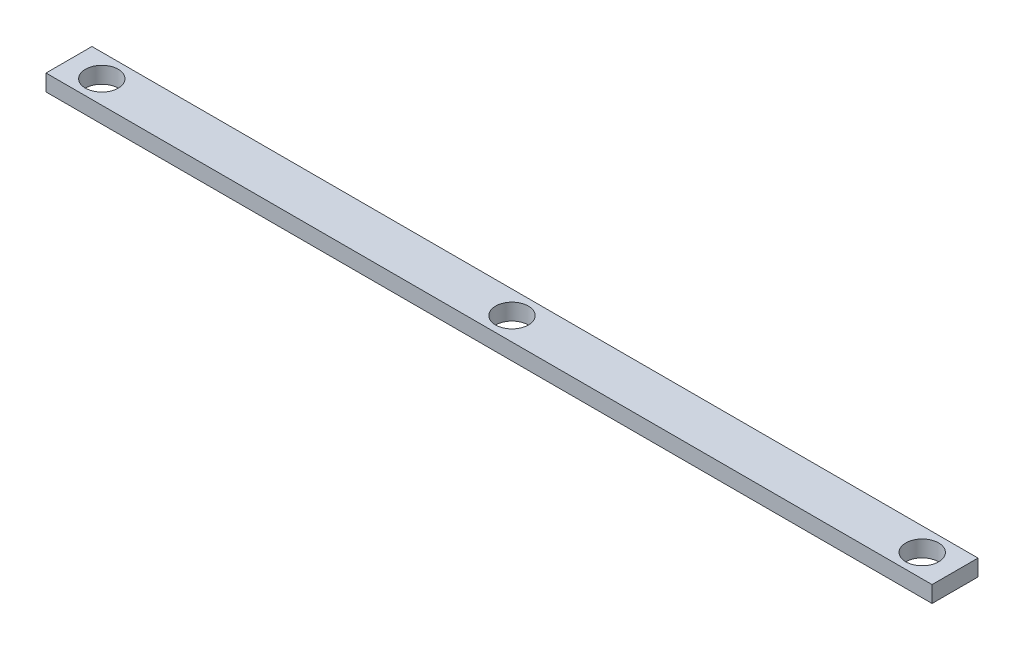
ISO-10303-21;
HEADER;
FILE_DESCRIPTION(('STEP AP214'),'2;1');
FILE_NAME('part.step','',(''),(''),'','','');
FILE_SCHEMA(('AUTOMOTIVE_DESIGN { 1 0 10303 214 1 1 1 1 }'));
ENDSEC;
DATA;
#1=APPLICATION_CONTEXT('core data for automotive mechanical design processes');
#2=APPLICATION_PROTOCOL_DEFINITION('international standard','automotive_design',2000,#1);
#3=PRODUCT_CONTEXT('',#1,'mechanical');
#4=PRODUCT('Part','Part','',(#3));
#5=PRODUCT_RELATED_PRODUCT_CATEGORY('part','',(#4));
#6=PRODUCT_DEFINITION_FORMATION('','',#4);
#7=PRODUCT_DEFINITION_CONTEXT('part definition',#1,'design');
#8=PRODUCT_DEFINITION('design','',#6,#7);
#9=PRODUCT_DEFINITION_SHAPE('','',#8);
#10=(LENGTH_UNIT() NAMED_UNIT(*) SI_UNIT(.MILLI.,.METRE.));
#11=(NAMED_UNIT(*) PLANE_ANGLE_UNIT() SI_UNIT($,.RADIAN.));
#12=(NAMED_UNIT(*) SI_UNIT($,.STERADIAN.) SOLID_ANGLE_UNIT());
#13=UNCERTAINTY_MEASURE_WITH_UNIT(LENGTH_MEASURE(1.E-05),#10,'distance_accuracy_value','');
#14=(GEOMETRIC_REPRESENTATION_CONTEXT(3) GLOBAL_UNCERTAINTY_ASSIGNED_CONTEXT((#13)) GLOBAL_UNIT_ASSIGNED_CONTEXT((#10,
#11,#12)) REPRESENTATION_CONTEXT('',''));
#15=CARTESIAN_POINT('',(0.,0.,0.));
#16=DIRECTION('',(0.,0.,1.));
#17=DIRECTION('',(1.,0.,0.));
#18=AXIS2_PLACEMENT_3D('',#15,#16,#17);
#19=CARTESIAN_POINT('',(0.,50.,0.));
#20=DIRECTION('',(0.,1.,0.));
#21=DIRECTION('',(0.,0.,1.));
#22=AXIS2_PLACEMENT_3D('',#19,#20,#21);
#23=PLANE('',#22);
#24=CARTESIAN_POINT('',(-11431.0304593336,50.,22932.9446458133));
#25=DIRECTION('',(0.,1.,0.));
#26=DIRECTION('',(0.,0.,1.));
#27=AXIS2_PLACEMENT_3D('',#24,#25,#26);
#28=CIRCLE('',#27,49.9999999999993);
#29=CARTESIAN_POINT('',(-11431.0304593336,50.,22982.9446458133));
#30=VERTEX_POINT('',#29);
#31=EDGE_CURVE('E124',#30,#30,#28,.T.);
#32=ORIENTED_EDGE('',*,*,#31,.F.);
#33=EDGE_LOOP('',(#32));
#34=FACE_BOUND('',#33,.T.);
#35=DIRECTION('',(1.,0.,0.));
#36=VECTOR('',#35,1.);
#37=CARTESIAN_POINT('',(-12781.0304593336,50.,23002.9446458133));
#38=LINE('',#37,#36);
#39=CARTESIAN_POINT('',(-12781.0304593336,50.,23002.9446458133));
#40=VERTEX_POINT('',#39);
#41=CARTESIAN_POINT('',(-10081.0304593336,50.,23002.9446458133));
#42=VERTEX_POINT('',#41);
#43=EDGE_CURVE('E94',#40,#42,#38,.T.);
#44=ORIENTED_EDGE('',*,*,#43,.T.);
#45=DIRECTION('',(0.,0.,-1.));
#46=VECTOR('',#45,1.);
#47=CARTESIAN_POINT('',(-10081.0304593336,50.,23002.9446458133));
#48=LINE('',#47,#46);
#49=CARTESIAN_POINT('',(-10081.0304593336,50.,22862.9446458133));
#50=VERTEX_POINT('',#49);
#51=EDGE_CURVE('E89',#42,#50,#48,.T.);
#52=ORIENTED_EDGE('',*,*,#51,.T.);
#53=DIRECTION('',(-1.,0.,0.));
#54=VECTOR('',#53,1.);
#55=CARTESIAN_POINT('',(-12781.0304593336,50.,22862.9446458133));
#56=LINE('',#55,#54);
#57=CARTESIAN_POINT('',(-12781.0304593336,50.,22862.9446458133));
#58=VERTEX_POINT('',#57);
#59=EDGE_CURVE('E92',#50,#58,#56,.T.);
#60=ORIENTED_EDGE('',*,*,#59,.T.);
#61=DIRECTION('',(0.,0.,1.));
#62=VECTOR('',#61,1.);
#63=CARTESIAN_POINT('',(-12781.0304593336,50.,23002.9446458133));
#64=LINE('',#63,#62);
#65=EDGE_CURVE('E59',#58,#40,#64,.T.);
#66=ORIENTED_EDGE('',*,*,#65,.T.);
#67=EDGE_LOOP('',(#44,#52,#60,#66));
#68=FACE_BOUND('',#67,.T.);
#69=CARTESIAN_POINT('',(-12681.0304593339,50.,22932.9446458131));
#70=DIRECTION('',(0.,1.,0.));
#71=DIRECTION('',(0.,0.,1.));
#72=AXIS2_PLACEMENT_3D('',#69,#70,#71);
#73=CIRCLE('',#72,49.9999999999993);
#74=CARTESIAN_POINT('',(-12681.0304593339,50.,22982.9446458131));
#75=VERTEX_POINT('',#74);
#76=EDGE_CURVE('E109',#75,#75,#73,.T.);
#77=ORIENTED_EDGE('',*,*,#76,.F.);
#78=EDGE_LOOP('',(#77));
#79=FACE_BOUND('',#78,.T.);
#80=CARTESIAN_POINT('',(-10181.0304593336,50.,22932.9446458133));
#81=DIRECTION('',(0.,1.,0.));
#82=DIRECTION('',(0.,0.,1.));
#83=AXIS2_PLACEMENT_3D('',#80,#81,#82);
#84=CIRCLE('',#83,49.9999999999993);
#85=CARTESIAN_POINT('',(-10181.0304593336,50.,22982.9446458133));
#86=VERTEX_POINT('',#85);
#87=EDGE_CURVE('E130',#86,#86,#84,.T.);
#88=ORIENTED_EDGE('',*,*,#87,.F.);
#89=EDGE_LOOP('',(#88));
#90=FACE_BOUND('',#89,.T.);
#91=ADVANCED_FACE('F42',(#34,#68,#79,#90),#23,.T.);
#92=CARTESIAN_POINT('',(0.,0.,0.));
#93=DIRECTION('',(0.,1.,0.));
#94=DIRECTION('',(0.,0.,1.));
#95=AXIS2_PLACEMENT_3D('',#92,#93,#94);
#96=PLANE('',#95);
#97=DIRECTION('',(1.,0.,0.));
#98=VECTOR('',#97,1.);
#99=CARTESIAN_POINT('',(-12781.0304593336,0.,23002.9446458133));
#100=LINE('',#99,#98);
#101=CARTESIAN_POINT('',(-12781.0304593336,0.,23002.9446458133));
#102=VERTEX_POINT('',#101);
#103=CARTESIAN_POINT('',(-10081.0304593336,0.,23002.9446458133));
#104=VERTEX_POINT('',#103);
#105=EDGE_CURVE('E106',#102,#104,#100,.T.);
#106=ORIENTED_EDGE('',*,*,#105,.F.);
#107=DIRECTION('',(0.,0.,1.));
#108=VECTOR('',#107,1.);
#109=CARTESIAN_POINT('',(-12781.0304593336,0.,23002.9446458133));
#110=LINE('',#109,#108);
#111=CARTESIAN_POINT('',(-12781.0304593336,0.,22862.9446458133));
#112=VERTEX_POINT('',#111);
#113=EDGE_CURVE('E82',#112,#102,#110,.T.);
#114=ORIENTED_EDGE('',*,*,#113,.F.);
#115=DIRECTION('',(-1.,0.,0.));
#116=VECTOR('',#115,1.);
#117=CARTESIAN_POINT('',(-12781.0304593336,0.,22862.9446458133));
#118=LINE('',#117,#116);
#119=CARTESIAN_POINT('',(-10081.0304593336,0.,22862.9446458133));
#120=VERTEX_POINT('',#119);
#121=EDGE_CURVE('E76',#120,#112,#118,.T.);
#122=ORIENTED_EDGE('',*,*,#121,.F.);
#123=DIRECTION('',(0.,0.,-1.));
#124=VECTOR('',#123,1.);
#125=CARTESIAN_POINT('',(-10081.0304593336,0.,23002.9446458133));
#126=LINE('',#125,#124);
#127=EDGE_CURVE('E98',#104,#120,#126,.T.);
#128=ORIENTED_EDGE('',*,*,#127,.F.);
#129=EDGE_LOOP('',(#106,#114,#122,#128));
#130=FACE_BOUND('',#129,.T.);
#131=CARTESIAN_POINT('',(-12681.0304593339,0.,22932.9446458131));
#132=DIRECTION('',(0.,1.,0.));
#133=DIRECTION('',(0.,0.,1.));
#134=AXIS2_PLACEMENT_3D('',#131,#132,#133);
#135=CIRCLE('',#134,49.9999999999993);
#136=CARTESIAN_POINT('',(-12681.0304593339,0.,22982.9446458131));
#137=VERTEX_POINT('',#136);
#138=EDGE_CURVE('E121',#137,#137,#135,.T.);
#139=ORIENTED_EDGE('',*,*,#138,.T.);
#140=EDGE_LOOP('',(#139));
#141=FACE_BOUND('',#140,.T.);
#142=CARTESIAN_POINT('',(-11431.0304593336,0.,22932.9446458133));
#143=DIRECTION('',(0.,1.,0.));
#144=DIRECTION('',(0.,0.,1.));
#145=AXIS2_PLACEMENT_3D('',#142,#143,#144);
#146=CIRCLE('',#145,49.9999999999993);
#147=CARTESIAN_POINT('',(-11431.0304593336,0.,22982.9446458133));
#148=VERTEX_POINT('',#147);
#149=EDGE_CURVE('E127',#148,#148,#146,.T.);
#150=ORIENTED_EDGE('',*,*,#149,.T.);
#151=EDGE_LOOP('',(#150));
#152=FACE_BOUND('',#151,.T.);
#153=CARTESIAN_POINT('',(-10181.0304593336,0.,22932.9446458133));
#154=DIRECTION('',(0.,1.,0.));
#155=DIRECTION('',(0.,0.,1.));
#156=AXIS2_PLACEMENT_3D('',#153,#154,#155);
#157=CIRCLE('',#156,49.9999999999993);
#158=CARTESIAN_POINT('',(-10181.0304593336,0.,22982.9446458133));
#159=VERTEX_POINT('',#158);
#160=EDGE_CURVE('E133',#159,#159,#157,.T.);
#161=ORIENTED_EDGE('',*,*,#160,.T.);
#162=EDGE_LOOP('',(#161));
#163=FACE_BOUND('',#162,.T.);
#164=ADVANCED_FACE('F117',(#130,#141,#152,#163),#96,.F.);
#165=CARTESIAN_POINT('',(-12781.0304593336,50.,23002.9446458133));
#166=DIRECTION('',(0.,0.,-1.));
#167=DIRECTION('',(-1.,0.,0.));
#168=AXIS2_PLACEMENT_3D('',#165,#166,#167);
#169=PLANE('',#168);
#170=ORIENTED_EDGE('',*,*,#105,.T.);
#171=DIRECTION('',(0.,-1.,0.));
#172=VECTOR('',#171,1.);
#173=CARTESIAN_POINT('',(-10081.0304593336,50.,23002.9446458133));
#174=LINE('',#173,#172);
#175=EDGE_CURVE('E13',#42,#104,#174,.T.);
#176=ORIENTED_EDGE('',*,*,#175,.F.);
#177=ORIENTED_EDGE('',*,*,#43,.F.);
#178=DIRECTION('',(0.,-1.,0.));
#179=VECTOR('',#178,1.);
#180=CARTESIAN_POINT('',(-12781.0304593336,50.,23002.9446458133));
#181=LINE('',#180,#179);
#182=EDGE_CURVE('E102',#40,#102,#181,.T.);
#183=ORIENTED_EDGE('',*,*,#182,.T.);
#184=EDGE_LOOP('',(#170,#176,#177,#183));
#185=FACE_BOUND('',#184,.T.);
#186=ADVANCED_FACE('F44',(#185),#169,.F.);
#187=CARTESIAN_POINT('',(-10081.0304593336,50.,23002.9446458133));
#188=DIRECTION('',(-1.,0.,0.));
#189=DIRECTION('',(0.,0.,1.));
#190=AXIS2_PLACEMENT_3D('',#187,#188,#189);
#191=PLANE('',#190);
#192=ORIENTED_EDGE('',*,*,#127,.T.);
#193=DIRECTION('',(0.,-1.,0.));
#194=VECTOR('',#193,1.);
#195=CARTESIAN_POINT('',(-10081.0304593336,50.,22862.9446458133));
#196=LINE('',#195,#194);
#197=EDGE_CURVE('E51',#50,#120,#196,.T.);
#198=ORIENTED_EDGE('',*,*,#197,.F.);
#199=ORIENTED_EDGE('',*,*,#51,.F.);
#200=ORIENTED_EDGE('',*,*,#175,.T.);
#201=EDGE_LOOP('',(#192,#198,#199,#200));
#202=FACE_BOUND('',#201,.T.);
#203=ADVANCED_FACE('F97',(#202),#191,.F.);
#204=CARTESIAN_POINT('',(-12781.0304593336,50.,22862.9446458133));
#205=DIRECTION('',(0.,0.,1.));
#206=DIRECTION('',(1.,0.,0.));
#207=AXIS2_PLACEMENT_3D('',#204,#205,#206);
#208=PLANE('',#207);
#209=ORIENTED_EDGE('',*,*,#121,.T.);
#210=DIRECTION('',(0.,-1.,0.));
#211=VECTOR('',#210,1.);
#212=CARTESIAN_POINT('',(-12781.0304593336,50.,22862.9446458133));
#213=LINE('',#212,#211);
#214=EDGE_CURVE('E99',#58,#112,#213,.T.);
#215=ORIENTED_EDGE('',*,*,#214,.F.);
#216=ORIENTED_EDGE('',*,*,#59,.F.);
#217=ORIENTED_EDGE('',*,*,#197,.T.);
#218=EDGE_LOOP('',(#209,#215,#216,#217));
#219=FACE_BOUND('',#218,.T.);
#220=ADVANCED_FACE('F100',(#219),#208,.F.);
#221=CARTESIAN_POINT('',(-12781.0304593336,50.,23002.9446458133));
#222=DIRECTION('',(1.,0.,0.));
#223=DIRECTION('',(0.,0.,-1.));
#224=AXIS2_PLACEMENT_3D('',#221,#222,#223);
#225=PLANE('',#224);
#226=ORIENTED_EDGE('',*,*,#113,.T.);
#227=ORIENTED_EDGE('',*,*,#182,.F.);
#228=ORIENTED_EDGE('',*,*,#65,.F.);
#229=ORIENTED_EDGE('',*,*,#214,.T.);
#230=EDGE_LOOP('',(#226,#227,#228,#229));
#231=FACE_BOUND('',#230,.T.);
#232=ADVANCED_FACE('F114',(#231),#225,.F.);
#233=CARTESIAN_POINT('',(-12681.0304593339,50.,22932.9446458131));
#234=DIRECTION('',(0.,-1.,0.));
#235=DIRECTION('',(0.,0.,-1.));
#236=AXIS2_PLACEMENT_3D('',#233,#234,#235);
#237=CYLINDRICAL_SURFACE('',#236,49.9999999999993);
#238=ORIENTED_EDGE('',*,*,#76,.T.);
#239=EDGE_LOOP('',(#238));
#240=FACE_BOUND('',#239,.T.);
#241=ORIENTED_EDGE('',*,*,#138,.F.);
#242=EDGE_LOOP('',(#241));
#243=FACE_BOUND('',#242,.T.);
#244=ADVANCED_FACE('F151',(#240,#243),#237,.F.);
#245=CARTESIAN_POINT('',(-11431.0304593336,50.,22932.9446458133));
#246=DIRECTION('',(0.,-1.,0.));
#247=DIRECTION('',(0.,0.,-1.));
#248=AXIS2_PLACEMENT_3D('',#245,#246,#247);
#249=CYLINDRICAL_SURFACE('',#248,49.9999999999993);
#250=ORIENTED_EDGE('',*,*,#31,.T.);
#251=EDGE_LOOP('',(#250));
#252=FACE_BOUND('',#251,.T.);
#253=ORIENTED_EDGE('',*,*,#149,.F.);
#254=EDGE_LOOP('',(#253));
#255=FACE_BOUND('',#254,.T.);
#256=ADVANCED_FACE('F197',(#252,#255),#249,.F.);
#257=CARTESIAN_POINT('',(-10181.0304593336,50.,22932.9446458133));
#258=DIRECTION('',(0.,-1.,0.));
#259=DIRECTION('',(0.,0.,-1.));
#260=AXIS2_PLACEMENT_3D('',#257,#258,#259);
#261=CYLINDRICAL_SURFACE('',#260,49.9999999999993);
#262=ORIENTED_EDGE('',*,*,#87,.T.);
#263=EDGE_LOOP('',(#262));
#264=FACE_BOUND('',#263,.T.);
#265=ORIENTED_EDGE('',*,*,#160,.F.);
#266=EDGE_LOOP('',(#265));
#267=FACE_BOUND('',#266,.T.);
#268=ADVANCED_FACE('F139',(#264,#267),#261,.F.);
#269=CLOSED_SHELL('',(#91,#164,#186,#203,#220,#232,#244,#256,#268));
#270=MANIFOLD_SOLID_BREP('B2',#269);
#271=ADVANCED_BREP_SHAPE_REPRESENTATION('',(#18,#270),#14);
#272=SHAPE_DEFINITION_REPRESENTATION(#9,#271);
ENDSEC;
END-ISO-10303-21;
